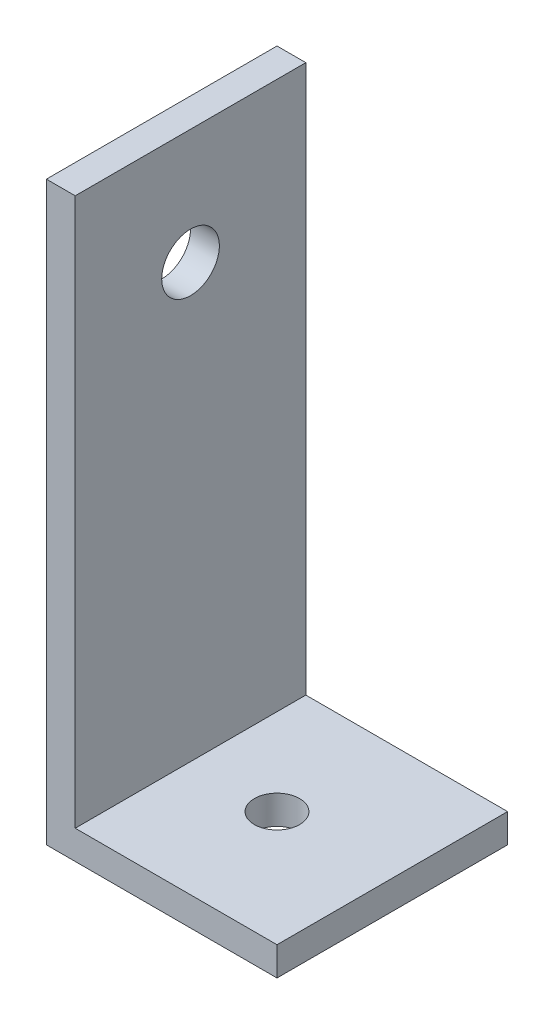
ISO-10303-21;
HEADER;
FILE_DESCRIPTION(('STEP AP214'),'2;1');
FILE_NAME('part.step','',(''),(''),'','','');
FILE_SCHEMA(('AUTOMOTIVE_DESIGN { 1 0 10303 214 1 1 1 1 }'));
ENDSEC;
DATA;
#1=APPLICATION_CONTEXT('core data for automotive mechanical design processes');
#2=APPLICATION_PROTOCOL_DEFINITION('international standard','automotive_design',2000,#1);
#3=PRODUCT_CONTEXT('',#1,'mechanical');
#4=PRODUCT('Part','Part','',(#3));
#5=PRODUCT_RELATED_PRODUCT_CATEGORY('part','',(#4));
#6=PRODUCT_DEFINITION_FORMATION('','',#4);
#7=PRODUCT_DEFINITION_CONTEXT('part definition',#1,'design');
#8=PRODUCT_DEFINITION('design','',#6,#7);
#9=PRODUCT_DEFINITION_SHAPE('','',#8);
#10=(LENGTH_UNIT() NAMED_UNIT(*) SI_UNIT(.MILLI.,.METRE.));
#11=(NAMED_UNIT(*) PLANE_ANGLE_UNIT() SI_UNIT($,.RADIAN.));
#12=(NAMED_UNIT(*) SI_UNIT($,.STERADIAN.) SOLID_ANGLE_UNIT());
#13=UNCERTAINTY_MEASURE_WITH_UNIT(LENGTH_MEASURE(1.E-05),#10,'distance_accuracy_value','');
#14=(GEOMETRIC_REPRESENTATION_CONTEXT(3) GLOBAL_UNCERTAINTY_ASSIGNED_CONTEXT((#13)) GLOBAL_UNIT_ASSIGNED_CONTEXT((#10,
#11,#12)) REPRESENTATION_CONTEXT('',''));
#15=CARTESIAN_POINT('',(0.,0.,0.));
#16=DIRECTION('',(0.,0.,1.));
#17=DIRECTION('',(1.,0.,0.));
#18=AXIS2_PLACEMENT_3D('',#15,#16,#17);
#19=CARTESIAN_POINT('',(25.4,0.,25.4));
#20=DIRECTION('',(0.,1.,0.));
#21=DIRECTION('',(-1.,0.,0.));
#22=AXIS2_PLACEMENT_3D('',#19,#20,#21);
#23=PLANE('',#22);
#24=DIRECTION('',(1.,0.,0.));
#25=VECTOR('',#24,1.);
#26=CARTESIAN_POINT('',(25.4,0.,0.));
#27=LINE('',#26,#25);
#28=CARTESIAN_POINT('',(0.,0.,0.));
#29=VERTEX_POINT('',#28);
#30=CARTESIAN_POINT('',(25.4,0.,0.));
#31=VERTEX_POINT('',#30);
#32=EDGE_CURVE('E118',#29,#31,#27,.T.);
#33=ORIENTED_EDGE('',*,*,#32,.T.);
#34=DIRECTION('',(0.,0.,-1.));
#35=VECTOR('',#34,1.);
#36=CARTESIAN_POINT('',(25.4,0.,25.4));
#37=LINE('',#36,#35);
#38=CARTESIAN_POINT('',(25.4,0.,25.4));
#39=VERTEX_POINT('',#38);
#40=EDGE_CURVE('E11',#39,#31,#37,.T.);
#41=ORIENTED_EDGE('',*,*,#40,.F.);
#42=DIRECTION('',(1.,0.,0.));
#43=VECTOR('',#42,1.);
#44=CARTESIAN_POINT('',(25.4,0.,25.4));
#45=LINE('',#44,#43);
#46=CARTESIAN_POINT('',(0.,0.,25.4));
#47=VERTEX_POINT('',#46);
#48=EDGE_CURVE('E129',#47,#39,#45,.T.);
#49=ORIENTED_EDGE('',*,*,#48,.F.);
#50=DIRECTION('',(0.,0.,-1.));
#51=VECTOR('',#50,1.);
#52=CARTESIAN_POINT('',(0.,0.,25.4));
#53=LINE('',#52,#51);
#54=EDGE_CURVE('E114',#47,#29,#53,.T.);
#55=ORIENTED_EDGE('',*,*,#54,.T.);
#56=EDGE_LOOP('',(#33,#41,#49,#55));
#57=FACE_BOUND('',#56,.T.);
#58=CARTESIAN_POINT('',(12.7,0.,12.7));
#59=DIRECTION('',(0.,-1.,0.));
#60=DIRECTION('',(0.,0.,-1.));
#61=AXIS2_PLACEMENT_3D('',#58,#59,#60);
#62=CIRCLE('',#61,2.48919999999999);
#63=CARTESIAN_POINT('',(12.7,0.,10.2108));
#64=VERTEX_POINT('',#63);
#65=EDGE_CURVE('E183',#64,#64,#62,.T.);
#66=ORIENTED_EDGE('',*,*,#65,.F.);
#67=EDGE_LOOP('',(#66));
#68=FACE_BOUND('',#67,.T.);
#69=ADVANCED_FACE('F34',(#57,#68),#23,.F.);
#70=CARTESIAN_POINT('',(25.4,3.175,25.4));
#71=DIRECTION('',(-1.,0.,0.));
#72=DIRECTION('',(0.,0.,1.));
#73=AXIS2_PLACEMENT_3D('',#70,#71,#72);
#74=PLANE('',#73);
#75=DIRECTION('',(0.,1.,0.));
#76=VECTOR('',#75,1.);
#77=CARTESIAN_POINT('',(25.4,3.175,0.));
#78=LINE('',#77,#76);
#79=CARTESIAN_POINT('',(25.4,3.175,0.));
#80=VERTEX_POINT('',#79);
#81=EDGE_CURVE('E121',#31,#80,#78,.T.);
#82=ORIENTED_EDGE('',*,*,#81,.T.);
#83=DIRECTION('',(0.,0.,-1.));
#84=VECTOR('',#83,1.);
#85=CARTESIAN_POINT('',(25.4,3.175,25.4));
#86=LINE('',#85,#84);
#87=CARTESIAN_POINT('',(25.4,3.175,25.4));
#88=VERTEX_POINT('',#87);
#89=EDGE_CURVE('E42',#88,#80,#86,.T.);
#90=ORIENTED_EDGE('',*,*,#89,.F.);
#91=DIRECTION('',(0.,1.,0.));
#92=VECTOR('',#91,1.);
#93=CARTESIAN_POINT('',(25.4,3.175,25.4));
#94=LINE('',#93,#92);
#95=EDGE_CURVE('E87',#39,#88,#94,.T.);
#96=ORIENTED_EDGE('',*,*,#95,.F.);
#97=ORIENTED_EDGE('',*,*,#40,.T.);
#98=EDGE_LOOP('',(#82,#90,#96,#97));
#99=FACE_BOUND('',#98,.T.);
#100=ADVANCED_FACE('F156',(#99),#74,.F.);
#101=CARTESIAN_POINT('',(3.17500000000001,3.175,25.4));
#102=DIRECTION('',(0.,-1.,0.));
#103=DIRECTION('',(0.,0.,-1.));
#104=AXIS2_PLACEMENT_3D('',#101,#102,#103);
#105=PLANE('',#104);
#106=CARTESIAN_POINT('',(12.7,3.175,12.7));
#107=DIRECTION('',(0.,-1.,0.));
#108=DIRECTION('',(0.,0.,-1.));
#109=AXIS2_PLACEMENT_3D('',#106,#107,#108);
#110=CIRCLE('',#109,2.48919999999999);
#111=CARTESIAN_POINT('',(12.7,3.175,10.2108));
#112=VERTEX_POINT('',#111);
#113=EDGE_CURVE('E176',#112,#112,#110,.T.);
#114=ORIENTED_EDGE('',*,*,#113,.T.);
#115=EDGE_LOOP('',(#114));
#116=FACE_BOUND('',#115,.T.);
#117=DIRECTION('',(-1.,0.,0.));
#118=VECTOR('',#117,1.);
#119=CARTESIAN_POINT('',(3.17500000000001,3.175,0.));
#120=LINE('',#119,#118);
#121=CARTESIAN_POINT('',(3.17500000000001,3.175,0.));
#122=VERTEX_POINT('',#121);
#123=EDGE_CURVE('E124',#80,#122,#120,.T.);
#124=ORIENTED_EDGE('',*,*,#123,.T.);
#125=DIRECTION('',(0.,0.,-1.));
#126=VECTOR('',#125,1.);
#127=CARTESIAN_POINT('',(3.17500000000001,3.175,25.4));
#128=LINE('',#127,#126);
#129=CARTESIAN_POINT('',(3.17500000000001,3.175,25.4));
#130=VERTEX_POINT('',#129);
#131=EDGE_CURVE('E109',#130,#122,#128,.T.);
#132=ORIENTED_EDGE('',*,*,#131,.F.);
#133=DIRECTION('',(-1.,0.,0.));
#134=VECTOR('',#133,1.);
#135=CARTESIAN_POINT('',(3.17500000000001,3.175,25.4));
#136=LINE('',#135,#134);
#137=EDGE_CURVE('E100',#88,#130,#136,.T.);
#138=ORIENTED_EDGE('',*,*,#137,.F.);
#139=ORIENTED_EDGE('',*,*,#89,.T.);
#140=EDGE_LOOP('',(#124,#132,#138,#139));
#141=FACE_BOUND('',#140,.T.);
#142=ADVANCED_FACE('F135',(#116,#141),#105,.F.);
#143=CARTESIAN_POINT('',(3.175,63.5,25.4));
#144=DIRECTION('',(-1.,0.,0.));
#145=DIRECTION('',(0.,-1.,0.));
#146=AXIS2_PLACEMENT_3D('',#143,#144,#145);
#147=PLANE('',#146);
#148=CARTESIAN_POINT('',(3.175,50.8,12.7));
#149=DIRECTION('',(-1.,0.,0.));
#150=DIRECTION('',(0.,-1.,0.));
#151=AXIS2_PLACEMENT_3D('',#148,#149,#150);
#152=CIRCLE('',#151,3.175);
#153=CARTESIAN_POINT('',(3.175,47.625,12.7));
#154=VERTEX_POINT('',#153);
#155=EDGE_CURVE('E122',#154,#154,#152,.T.);
#156=ORIENTED_EDGE('',*,*,#155,.T.);
#157=EDGE_LOOP('',(#156));
#158=FACE_BOUND('',#157,.T.);
#159=DIRECTION('',(0.,1.,0.));
#160=VECTOR('',#159,1.);
#161=CARTESIAN_POINT('',(3.175,63.5,0.));
#162=LINE('',#161,#160);
#163=CARTESIAN_POINT('',(3.175,63.5,0.));
#164=VERTEX_POINT('',#163);
#165=EDGE_CURVE('E108',#122,#164,#162,.T.);
#166=ORIENTED_EDGE('',*,*,#165,.T.);
#167=DIRECTION('',(0.,0.,-1.));
#168=VECTOR('',#167,1.);
#169=CARTESIAN_POINT('',(3.175,63.5,25.4));
#170=LINE('',#169,#168);
#171=CARTESIAN_POINT('',(3.175,63.5,25.4));
#172=VERTEX_POINT('',#171);
#173=EDGE_CURVE('E105',#172,#164,#170,.T.);
#174=ORIENTED_EDGE('',*,*,#173,.F.);
#175=DIRECTION('',(0.,1.,0.));
#176=VECTOR('',#175,1.);
#177=CARTESIAN_POINT('',(3.175,63.5,25.4));
#178=LINE('',#177,#176);
#179=EDGE_CURVE('E94',#130,#172,#178,.T.);
#180=ORIENTED_EDGE('',*,*,#179,.F.);
#181=ORIENTED_EDGE('',*,*,#131,.T.);
#182=EDGE_LOOP('',(#166,#174,#180,#181));
#183=FACE_BOUND('',#182,.T.);
#184=ADVANCED_FACE('F106',(#158,#183),#147,.F.);
#185=CARTESIAN_POINT('',(0.,63.5,25.4));
#186=DIRECTION('',(0.,-1.,0.));
#187=DIRECTION('',(0.,0.,-1.));
#188=AXIS2_PLACEMENT_3D('',#185,#186,#187);
#189=PLANE('',#188);
#190=DIRECTION('',(-1.,0.,0.));
#191=VECTOR('',#190,1.);
#192=CARTESIAN_POINT('',(0.,63.5,0.));
#193=LINE('',#192,#191);
#194=CARTESIAN_POINT('',(0.,63.5,0.));
#195=VERTEX_POINT('',#194);
#196=EDGE_CURVE('E73',#164,#195,#193,.T.);
#197=ORIENTED_EDGE('',*,*,#196,.T.);
#198=DIRECTION('',(0.,0.,-1.));
#199=VECTOR('',#198,1.);
#200=CARTESIAN_POINT('',(0.,63.5,25.4));
#201=LINE('',#200,#199);
#202=CARTESIAN_POINT('',(0.,63.5,25.4));
#203=VERTEX_POINT('',#202);
#204=EDGE_CURVE('E110',#203,#195,#201,.T.);
#205=ORIENTED_EDGE('',*,*,#204,.F.);
#206=DIRECTION('',(-1.,0.,0.));
#207=VECTOR('',#206,1.);
#208=CARTESIAN_POINT('',(0.,63.5,25.4));
#209=LINE('',#208,#207);
#210=EDGE_CURVE('E98',#172,#203,#209,.T.);
#211=ORIENTED_EDGE('',*,*,#210,.F.);
#212=ORIENTED_EDGE('',*,*,#173,.T.);
#213=EDGE_LOOP('',(#197,#205,#211,#212));
#214=FACE_BOUND('',#213,.T.);
#215=ADVANCED_FACE('F112',(#214),#189,.F.);
#216=CARTESIAN_POINT('',(0.,0.,25.4));
#217=DIRECTION('',(1.,0.,0.));
#218=DIRECTION('',(0.,0.,-1.));
#219=AXIS2_PLACEMENT_3D('',#216,#217,#218);
#220=PLANE('',#219);
#221=CARTESIAN_POINT('',(0.,50.8,12.7));
#222=DIRECTION('',(-1.,0.,0.));
#223=DIRECTION('',(0.,0.,1.));
#224=AXIS2_PLACEMENT_3D('',#221,#222,#223);
#225=CIRCLE('',#224,3.175);
#226=CARTESIAN_POINT('',(0.,50.8,15.875));
#227=VERTEX_POINT('',#226);
#228=EDGE_CURVE('E173',#227,#227,#225,.T.);
#229=ORIENTED_EDGE('',*,*,#228,.F.);
#230=EDGE_LOOP('',(#229));
#231=FACE_BOUND('',#230,.T.);
#232=DIRECTION('',(0.,-1.,0.));
#233=VECTOR('',#232,1.);
#234=CARTESIAN_POINT('',(0.,0.,0.));
#235=LINE('',#234,#233);
#236=EDGE_CURVE('E79',#195,#29,#235,.T.);
#237=ORIENTED_EDGE('',*,*,#236,.T.);
#238=ORIENTED_EDGE('',*,*,#54,.F.);
#239=DIRECTION('',(0.,-1.,0.));
#240=VECTOR('',#239,1.);
#241=CARTESIAN_POINT('',(0.,0.,25.4));
#242=LINE('',#241,#240);
#243=EDGE_CURVE('E50',#203,#47,#242,.T.);
#244=ORIENTED_EDGE('',*,*,#243,.F.);
#245=ORIENTED_EDGE('',*,*,#204,.T.);
#246=EDGE_LOOP('',(#237,#238,#244,#245));
#247=FACE_BOUND('',#246,.T.);
#248=ADVANCED_FACE('F143',(#231,#247),#220,.F.);
#249=CARTESIAN_POINT('',(0.,0.,25.4));
#250=DIRECTION('',(0.,0.,-1.));
#251=DIRECTION('',(-1.,0.,0.));
#252=AXIS2_PLACEMENT_3D('',#249,#250,#251);
#253=PLANE('',#252);
#254=ORIENTED_EDGE('',*,*,#48,.T.);
#255=ORIENTED_EDGE('',*,*,#95,.T.);
#256=ORIENTED_EDGE('',*,*,#137,.T.);
#257=ORIENTED_EDGE('',*,*,#179,.T.);
#258=ORIENTED_EDGE('',*,*,#210,.T.);
#259=ORIENTED_EDGE('',*,*,#243,.T.);
#260=EDGE_LOOP('',(#254,#255,#256,#257,#258,#259));
#261=FACE_BOUND('',#260,.T.);
#262=ADVANCED_FACE('F96',(#261),#253,.F.);
#263=CARTESIAN_POINT('',(0.,0.,0.));
#264=DIRECTION('',(0.,0.,-1.));
#265=DIRECTION('',(-1.,0.,0.));
#266=AXIS2_PLACEMENT_3D('',#263,#264,#265);
#267=PLANE('',#266);
#268=ORIENTED_EDGE('',*,*,#32,.F.);
#269=ORIENTED_EDGE('',*,*,#236,.F.);
#270=ORIENTED_EDGE('',*,*,#196,.F.);
#271=ORIENTED_EDGE('',*,*,#165,.F.);
#272=ORIENTED_EDGE('',*,*,#123,.F.);
#273=ORIENTED_EDGE('',*,*,#81,.F.);
#274=EDGE_LOOP('',(#268,#269,#270,#271,#272,#273));
#275=FACE_BOUND('',#274,.T.);
#276=ADVANCED_FACE('F138',(#275),#267,.T.);
#277=CARTESIAN_POINT('',(25.4,50.8,12.7));
#278=DIRECTION('',(-1.,0.,0.));
#279=DIRECTION('',(0.,0.,1.));
#280=AXIS2_PLACEMENT_3D('',#277,#278,#279);
#281=CYLINDRICAL_SURFACE('',#280,3.175);
#282=ORIENTED_EDGE('',*,*,#228,.T.);
#283=EDGE_LOOP('',(#282));
#284=FACE_BOUND('',#283,.T.);
#285=ORIENTED_EDGE('',*,*,#155,.F.);
#286=EDGE_LOOP('',(#285));
#287=FACE_BOUND('',#286,.T.);
#288=ADVANCED_FACE('F189',(#284,#287),#281,.F.);
#289=CARTESIAN_POINT('',(12.7,0.,12.7));
#290=DIRECTION('',(0.,-1.,0.));
#291=DIRECTION('',(0.,0.,-1.));
#292=AXIS2_PLACEMENT_3D('',#289,#290,#291);
#293=CYLINDRICAL_SURFACE('',#292,2.48919999999999);
#294=ORIENTED_EDGE('',*,*,#113,.F.);
#295=EDGE_LOOP('',(#294));
#296=FACE_BOUND('',#295,.T.);
#297=ORIENTED_EDGE('',*,*,#65,.T.);
#298=EDGE_LOOP('',(#297));
#299=FACE_BOUND('',#298,.T.);
#300=ADVANCED_FACE('F187',(#296,#299),#293,.F.);
#301=CLOSED_SHELL('',(#69,#100,#142,#184,#215,#248,#262,#276,#288,#300));
#302=MANIFOLD_SOLID_BREP('B2',#301);
#303=ADVANCED_BREP_SHAPE_REPRESENTATION('',(#18,#302),#14);
#304=SHAPE_DEFINITION_REPRESENTATION(#9,#303);
ENDSEC;
END-ISO-10303-21;
